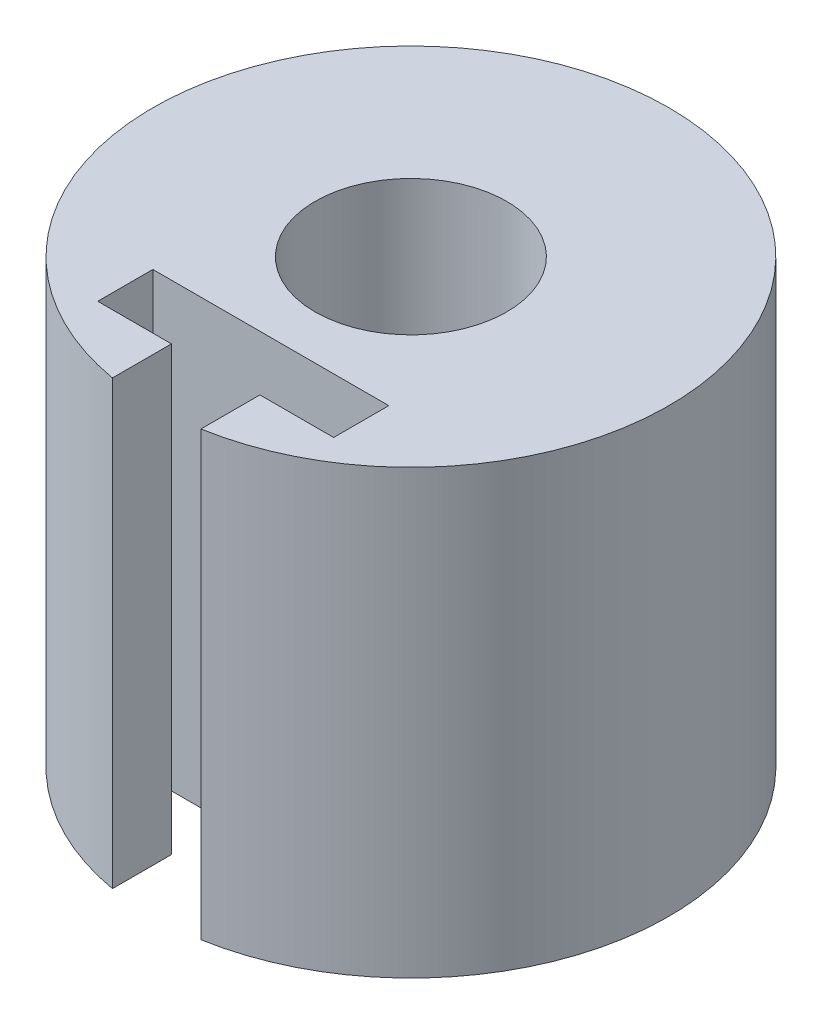
ISO-10303-21;
HEADER;
FILE_DESCRIPTION(('STEP AP214'),'2;1');
FILE_NAME('part.step','',(''),(''),'','','');
FILE_SCHEMA(('AUTOMOTIVE_DESIGN { 1 0 10303 214 1 1 1 1 }'));
ENDSEC;
DATA;
#1=APPLICATION_CONTEXT('core data for automotive mechanical design processes');
#2=APPLICATION_PROTOCOL_DEFINITION('international standard','automotive_design',2000,#1);
#3=PRODUCT_CONTEXT('',#1,'mechanical');
#4=PRODUCT('Part','Part','',(#3));
#5=PRODUCT_RELATED_PRODUCT_CATEGORY('part','',(#4));
#6=PRODUCT_DEFINITION_FORMATION('','',#4);
#7=PRODUCT_DEFINITION_CONTEXT('part definition',#1,'design');
#8=PRODUCT_DEFINITION('design','',#6,#7);
#9=PRODUCT_DEFINITION_SHAPE('','',#8);
#10=(LENGTH_UNIT() NAMED_UNIT(*) SI_UNIT(.MILLI.,.METRE.));
#11=(NAMED_UNIT(*) PLANE_ANGLE_UNIT() SI_UNIT($,.RADIAN.));
#12=(NAMED_UNIT(*) SI_UNIT($,.STERADIAN.) SOLID_ANGLE_UNIT());
#13=UNCERTAINTY_MEASURE_WITH_UNIT(LENGTH_MEASURE(1.E-05),#10,'distance_accuracy_value','');
#14=(GEOMETRIC_REPRESENTATION_CONTEXT(3) GLOBAL_UNCERTAINTY_ASSIGNED_CONTEXT((#13)) GLOBAL_UNIT_ASSIGNED_CONTEXT((#10,
#11,#12)) REPRESENTATION_CONTEXT('',''));
#15=CARTESIAN_POINT('',(0.,0.,0.));
#16=DIRECTION('',(0.,0.,1.));
#17=DIRECTION('',(1.,0.,0.));
#18=AXIS2_PLACEMENT_3D('',#15,#16,#17);
#19=CARTESIAN_POINT('',(0.,15.,0.));
#20=DIRECTION('',(0.,1.,0.));
#21=DIRECTION('',(0.,0.,1.));
#22=AXIS2_PLACEMENT_3D('',#19,#20,#21);
#23=PLANE('',#22);
#24=DIRECTION('',(-1.,0.,0.));
#25=VECTOR('',#24,1.);
#26=CARTESIAN_POINT('',(1.5,15.,4.75));
#27=LINE('',#26,#25);
#28=CARTESIAN_POINT('',(4.,15.,4.75));
#29=VERTEX_POINT('',#28);
#30=CARTESIAN_POINT('',(-4.,15.,4.75));
#31=VERTEX_POINT('',#30);
#32=EDGE_CURVE('E117',#29,#31,#27,.T.);
#33=ORIENTED_EDGE('',*,*,#32,.F.);
#34=DIRECTION('',(0.,0.,-1.));
#35=VECTOR('',#34,1.);
#36=CARTESIAN_POINT('',(4.,15.,6.62046982478334));
#37=LINE('',#36,#35);
#38=CARTESIAN_POINT('',(4.,15.,6.62046982478334));
#39=VERTEX_POINT('',#38);
#40=EDGE_CURVE('E126',#39,#29,#37,.T.);
#41=ORIENTED_EDGE('',*,*,#40,.F.);
#42=DIRECTION('',(-1.,0.,0.));
#43=VECTOR('',#42,1.);
#44=CARTESIAN_POINT('',(4.,15.,6.62046982478334));
#45=LINE('',#44,#43);
#46=CARTESIAN_POINT('',(1.5,15.,6.62046982478334));
#47=VERTEX_POINT('',#46);
#48=EDGE_CURVE('E153',#39,#47,#45,.T.);
#49=ORIENTED_EDGE('',*,*,#48,.T.);
#50=DIRECTION('',(0.,0.,1.));
#51=VECTOR('',#50,1.);
#52=CARTESIAN_POINT('',(1.5,15.,4.75));
#53=LINE('',#52,#51);
#54=CARTESIAN_POINT('',(1.5,15.,8.62046982478333));
#55=VERTEX_POINT('',#54);
#56=EDGE_CURVE('E240',#47,#55,#53,.T.);
#57=ORIENTED_EDGE('',*,*,#56,.T.);
#58=CARTESIAN_POINT('',(0.,15.,0.));
#59=DIRECTION('',(0.,1.,0.));
#60=DIRECTION('',(0.,0.,1.));
#61=AXIS2_PLACEMENT_3D('',#58,#59,#60);
#62=CIRCLE('',#61,8.75);
#63=CARTESIAN_POINT('',(-1.5,15.,8.62046982478333));
#64=VERTEX_POINT('',#63);
#65=EDGE_CURVE('E218',#55,#64,#62,.T.);
#66=ORIENTED_EDGE('',*,*,#65,.T.);
#67=DIRECTION('',(0.,0.,1.));
#68=VECTOR('',#67,1.);
#69=CARTESIAN_POINT('',(-1.5,15.,4.75));
#70=LINE('',#69,#68);
#71=CARTESIAN_POINT('',(-1.5,15.,6.62046982478334));
#72=VERTEX_POINT('',#71);
#73=EDGE_CURVE('E232',#72,#64,#70,.T.);
#74=ORIENTED_EDGE('',*,*,#73,.F.);
#75=CARTESIAN_POINT('',(-4.,15.,6.62046982478334));
#76=VERTEX_POINT('',#75);
#77=EDGE_CURVE('E56',#72,#76,#45,.T.);
#78=ORIENTED_EDGE('',*,*,#77,.T.);
#79=DIRECTION('',(0.,0.,-1.));
#80=VECTOR('',#79,1.);
#81=CARTESIAN_POINT('',(-4.,15.,6.62046982478334));
#82=LINE('',#81,#80);
#83=EDGE_CURVE('E128',#76,#31,#82,.T.);
#84=ORIENTED_EDGE('',*,*,#83,.T.);
#85=EDGE_LOOP('',(#33,#41,#49,#57,#66,#74,#78,#84));
#86=FACE_BOUND('',#85,.T.);
#87=CARTESIAN_POINT('',(0.,15.,0.));
#88=DIRECTION('',(0.,1.,0.));
#89=DIRECTION('',(0.,0.,1.));
#90=AXIS2_PLACEMENT_3D('',#87,#88,#89);
#91=CIRCLE('',#90,3.25);
#92=CARTESIAN_POINT('',(0.,15.,3.25));
#93=VERTEX_POINT('',#92);
#94=EDGE_CURVE('E219',#93,#93,#91,.T.);
#95=ORIENTED_EDGE('',*,*,#94,.F.);
#96=EDGE_LOOP('',(#95));
#97=FACE_BOUND('',#96,.T.);
#98=ADVANCED_FACE('F39',(#86,#97),#23,.T.);
#99=CARTESIAN_POINT('',(0.,0.,0.));
#100=DIRECTION('',(0.,1.,0.));
#101=DIRECTION('',(0.,0.,1.));
#102=AXIS2_PLACEMENT_3D('',#99,#100,#101);
#103=PLANE('',#102);
#104=DIRECTION('',(0.,0.,1.));
#105=VECTOR('',#104,1.);
#106=CARTESIAN_POINT('',(4.,0.,6.62046982478334));
#107=LINE('',#106,#105);
#108=CARTESIAN_POINT('',(4.,0.,4.75));
#109=VERTEX_POINT('',#108);
#110=CARTESIAN_POINT('',(4.,0.,6.62046982478334));
#111=VERTEX_POINT('',#110);
#112=EDGE_CURVE('E124',#109,#111,#107,.T.);
#113=ORIENTED_EDGE('',*,*,#112,.F.);
#114=DIRECTION('',(1.,0.,0.));
#115=VECTOR('',#114,1.);
#116=CARTESIAN_POINT('',(1.5,0.,4.75));
#117=LINE('',#116,#115);
#118=CARTESIAN_POINT('',(-4.,0.,4.75));
#119=VERTEX_POINT('',#118);
#120=EDGE_CURVE('E105',#119,#109,#117,.T.);
#121=ORIENTED_EDGE('',*,*,#120,.F.);
#122=DIRECTION('',(0.,0.,1.));
#123=VECTOR('',#122,1.);
#124=CARTESIAN_POINT('',(-4.,0.,6.62046982478334));
#125=LINE('',#124,#123);
#126=CARTESIAN_POINT('',(-4.,0.,6.62046982478334));
#127=VERTEX_POINT('',#126);
#128=EDGE_CURVE('E144',#119,#127,#125,.T.);
#129=ORIENTED_EDGE('',*,*,#128,.T.);
#130=DIRECTION('',(-1.,0.,0.));
#131=VECTOR('',#130,1.);
#132=CARTESIAN_POINT('',(4.,0.,6.62046982478334));
#133=LINE('',#132,#131);
#134=CARTESIAN_POINT('',(-1.5,0.,6.62046982478334));
#135=VERTEX_POINT('',#134);
#136=EDGE_CURVE('E141',#135,#127,#133,.T.);
#137=ORIENTED_EDGE('',*,*,#136,.F.);
#138=DIRECTION('',(0.,0.,1.));
#139=VECTOR('',#138,1.);
#140=CARTESIAN_POINT('',(-1.5,0.,4.75));
#141=LINE('',#140,#139);
#142=CARTESIAN_POINT('',(-1.5,0.,8.62046982478333));
#143=VERTEX_POINT('',#142);
#144=EDGE_CURVE('E234',#135,#143,#141,.T.);
#145=ORIENTED_EDGE('',*,*,#144,.T.);
#146=CARTESIAN_POINT('',(0.,0.,0.));
#147=DIRECTION('',(0.,1.,0.));
#148=DIRECTION('',(0.,0.,1.));
#149=AXIS2_PLACEMENT_3D('',#146,#147,#148);
#150=CIRCLE('',#149,8.75);
#151=CARTESIAN_POINT('',(1.5,0.,8.62046982478333));
#152=VERTEX_POINT('',#151);
#153=EDGE_CURVE('E211',#152,#143,#150,.T.);
#154=ORIENTED_EDGE('',*,*,#153,.F.);
#155=DIRECTION('',(0.,0.,1.));
#156=VECTOR('',#155,1.);
#157=CARTESIAN_POINT('',(1.5,0.,4.75));
#158=LINE('',#157,#156);
#159=CARTESIAN_POINT('',(1.5,0.,6.62046982478334));
#160=VERTEX_POINT('',#159);
#161=EDGE_CURVE('E237',#160,#152,#158,.T.);
#162=ORIENTED_EDGE('',*,*,#161,.F.);
#163=EDGE_CURVE('E64',#111,#160,#133,.T.);
#164=ORIENTED_EDGE('',*,*,#163,.F.);
#165=EDGE_LOOP('',(#113,#121,#129,#137,#145,#154,#162,#164));
#166=FACE_BOUND('',#165,.T.);
#167=CARTESIAN_POINT('',(0.,0.,0.));
#168=DIRECTION('',(0.,1.,0.));
#169=DIRECTION('',(0.,0.,1.));
#170=AXIS2_PLACEMENT_3D('',#167,#168,#169);
#171=CIRCLE('',#170,3.25);
#172=CARTESIAN_POINT('',(0.,0.,3.25));
#173=VERTEX_POINT('',#172);
#174=EDGE_CURVE('E225',#173,#173,#171,.T.);
#175=ORIENTED_EDGE('',*,*,#174,.T.);
#176=EDGE_LOOP('',(#175));
#177=FACE_BOUND('',#176,.T.);
#178=ADVANCED_FACE('F130',(#166,#177),#103,.F.);
#179=CARTESIAN_POINT('',(0.,15.,0.));
#180=DIRECTION('',(0.,-1.,0.));
#181=DIRECTION('',(0.,0.,-1.));
#182=AXIS2_PLACEMENT_3D('',#179,#180,#181);
#183=CYLINDRICAL_SURFACE('',#182,8.75);
#184=CARTESIAN_POINT('',(-1.25,7.5,-8.66025403784439));
#185=CARTESIAN_POINT('',(-1.2499970882253,7.43017239298044,-8.66025516085875));
#186=CARTESIAN_POINT('',(-1.24412915317117,7.36030330453426,-8.66110770052372));
#187=CARTESIAN_POINT('',(-1.2208171258649,7.22251585225125,-8.66442374528039));
#188=CARTESIAN_POINT('',(-1.20336149763599,7.15459950280618,-8.66688885571018));
#189=CARTESIAN_POINT('',(-1.15740461772674,7.0227320624764,-8.67314526632927));
#190=CARTESIAN_POINT('',(-1.12891154451268,6.95877807618568,-8.67693558437125));
#191=CARTESIAN_POINT('',(-1.06170734930789,6.83656891908396,-8.68541416628935));
#192=CARTESIAN_POINT('',(-1.02299773687961,6.77831290810022,-8.69010229747946));
#193=CARTESIAN_POINT('',(-0.936158417751142,6.66871981509502,-8.69988640783336));
#194=CARTESIAN_POINT('',(-0.887969102670785,6.61743017883371,-8.70498484045085));
#195=CARTESIAN_POINT('',(-0.783666924354489,6.52363652672474,-8.71499314449397));
#196=CARTESIAN_POINT('',(-0.72755363865696,6.48113297959986,-8.71990300584828));
#197=CARTESIAN_POINT('',(-0.608693990012801,6.40594431390017,-8.72900648139207));
#198=CARTESIAN_POINT('',(-0.545919853885056,6.37330267842597,-8.73319688933394));
#199=CARTESIAN_POINT('',(-0.415710466226937,6.31904329042012,-8.74036219658094));
#200=CARTESIAN_POINT('',(-0.348275438774581,6.29742500834538,-8.74333715427286));
#201=CARTESIAN_POINT('',(-0.211146289713093,6.26596924564733,-8.74771906255606));
#202=CARTESIAN_POINT('',(-0.141470703168673,6.2560524562711,-8.74913656448817));
#203=CARTESIAN_POINT('',(-0.00143097829899894,6.24803506339587,-8.75027997177396));
#204=CARTESIAN_POINT('',(0.0689331249628623,6.24993386127118,-8.75000596282645));
#205=CARTESIAN_POINT('',(0.207811870116169,6.26543086138488,-8.74780568414539));
#206=CARTESIAN_POINT('',(0.276336249856897,6.27894374930157,-8.74589146332768));
#207=CARTESIAN_POINT('',(0.410134746955434,6.317151599812,-8.74063928382897));
#208=CARTESIAN_POINT('',(0.475408787038677,6.34184682811737,-8.73730129131682));
#209=CARTESIAN_POINT('',(0.601113729229836,6.40180671548973,-8.72955587731864));
#210=CARTESIAN_POINT('',(0.661527120494418,6.43710759444927,-8.7251448010732));
#211=CARTESIAN_POINT('',(0.775604887586029,6.51725030796266,-8.71574541685143));
#212=CARTESIAN_POINT('',(0.829268859632394,6.56209271290201,-8.71075707437468));
#213=CARTESIAN_POINT('',(0.928826869414913,6.66052162604749,-8.70070753089877));
#214=CARTESIAN_POINT('',(0.974647308326149,6.71418258296824,-8.69564607694519));
#215=CARTESIAN_POINT('',(1.05664368493827,6.82847157589343,-8.6860643367229));
#216=CARTESIAN_POINT('',(1.09281957322612,6.88909964759101,-8.68154405322691));
#217=CARTESIAN_POINT('',(1.15450813450497,7.01567518119136,-8.67355658551828));
#218=CARTESIAN_POINT('',(1.18001375157361,7.08162612867663,-8.67009009856167));
#219=CARTESIAN_POINT('',(1.219566398177,7.21693598739118,-8.66461541130593));
#220=CARTESIAN_POINT('',(1.23361415675189,7.28629468149473,-8.6626071182258));
#221=CARTESIAN_POINT('',(1.24975244180121,7.42579783589377,-8.66029362973324));
#222=CARTESIAN_POINT('',(1.25194706940295,7.49593001624724,-8.65997360751942));
#223=CARTESIAN_POINT('',(1.2445925515445,7.63556112814072,-8.66103357832946));
#224=CARTESIAN_POINT('',(1.23504373552106,7.70506007738956,-8.66241352366445));
#225=CARTESIAN_POINT('',(1.20456148659501,7.84113261251778,-8.66670435328227));
#226=CARTESIAN_POINT('',(1.18367947402763,7.90771795441584,-8.66960832090782));
#227=CARTESIAN_POINT('',(1.13117691357165,8.03644299841031,-8.67661432007607));
#228=CARTESIAN_POINT('',(1.09955588106338,8.09858249972608,-8.68071640568507));
#229=CARTESIAN_POINT('',(1.02622100207016,8.21711992482593,-8.68969155258386));
#230=CARTESIAN_POINT('',(0.98443950016953,8.27347560075772,-8.6945697028269));
#231=CARTESIAN_POINT('',(0.892064236383529,8.37841232726594,-8.70453181791204));
#232=CARTESIAN_POINT('',(0.841470023876353,8.42699298003695,-8.70961579326842));
#233=CARTESIAN_POINT('',(0.732448178928346,8.51537201152112,-8.71946282758694));
#234=CARTESIAN_POINT('',(0.673964482577705,8.5551015764497,-8.72422318476158));
#235=CARTESIAN_POINT('',(0.551092940481996,8.62417222695982,-8.73284513474877));
#236=CARTESIAN_POINT('',(0.486705243860285,8.65351357483622,-8.73670675025305));
#237=CARTESIAN_POINT('',(0.354072452871208,8.70086382144732,-8.74308423652776));
#238=CARTESIAN_POINT('',(0.285841249452456,8.71891099289218,-8.74560464785764));
#239=CARTESIAN_POINT('',(0.147278286903616,8.74328466694163,-8.74903474447829));
#240=CARTESIAN_POINT('',(0.0769466533214239,8.74961186865866,-8.74994452584523));
#241=CARTESIAN_POINT('',(-0.0631519566419731,8.75035014934029,-8.75005004794948));
#242=CARTESIAN_POINT('',(-0.132918388594115,8.74486676188652,-8.74926096888997));
#243=CARTESIAN_POINT('',(-0.27052664592492,8.7223649062231,-8.74608790171903));
#244=CARTESIAN_POINT('',(-0.338368475847152,8.70534646524758,-8.74370391737315));
#245=CARTESIAN_POINT('',(-0.470177321560782,8.66029376410738,-8.73760763783911));
#246=CARTESIAN_POINT('',(-0.534146643879365,8.63226613719704,-8.73389614262293));
#247=CARTESIAN_POINT('',(-0.656491066157176,8.56600178174873,-8.72555350063933));
#248=CARTESIAN_POINT('',(-0.714866018729095,8.52776478433868,-8.72092232965232));
#249=CARTESIAN_POINT('',(-0.824901218501657,8.44178267798539,-8.71120654664669));
#250=CARTESIAN_POINT('',(-0.87650010394991,8.39395943322969,-8.7061184116192));
#251=CARTESIAN_POINT('',(-0.970979479545268,8.29032652485293,-8.69608889641356));
#252=CARTESIAN_POINT('',(-1.01385791644206,8.23451498562715,-8.69114755103072));
#253=CARTESIAN_POINT('',(-1.08987202172246,8.11615910104024,-8.68194429907431));
#254=CARTESIAN_POINT('',(-1.12295721438123,8.05358206849311,-8.67768596267398));
#255=CARTESIAN_POINT('',(-1.17809939066933,7.92372981462212,-8.67037267584611));
#256=CARTESIAN_POINT('',(-1.20016798701335,7.85645962605154,-8.6673164589752));
#257=CARTESIAN_POINT('',(-1.22755784478488,7.74072723385606,-8.66347057636991));
#258=CARTESIAN_POINT('',(-1.23596101580969,7.69298479036888,-8.66227064996284));
#259=CARTESIAN_POINT('',(-1.24718307192828,7.59683487689588,-8.66066199569781));
#260=CARTESIAN_POINT('',(-1.25000201939786,7.54842741434441,-8.66025325900226));
#261=CARTESIAN_POINT('',(-1.25,7.5,-8.66025403784439));
#262=B_SPLINE_CURVE_WITH_KNOTS('',3,(#184,#185,#186,#187,#188,#189,#190,#191,#192,#193,#194,
#195,#196,#197,#198,#199,#200,#201,#202,#203,#204,#205,#206,#207,#208,#209,#210,#211,#212,#213,
#214,#215,#216,#217,#218,#219,#220,#221,#222,#223,#224,#225,#226,#227,#228,#229,#230,#231,#232,
#233,#234,#235,#236,#237,#238,#239,#240,#241,#242,#243,#244,#245,#246,#247,#248,#249,#250,#251,
#252,#253,#254,#255,#256,#257,#258,#259,#260,#261),.UNSPECIFIED.,.T.,.F.,(4,2,2,2,2,2,2,2,2,2,2,
2,2,2,2,2,2,2,2,2,2,2,2,2,2,2,2,2,2,2,2,2,2,2,2,2,2,2,4),(0.,0.209305843372431,0.41882037156305,
0.628179950855115,0.837508613161047,1.0481982227905,1.25889906944998,1.47051581670914,
1.682122397303,1.89228638835049,2.10243973172225,2.31106240565563,2.51969003708232,
2.72903842274279,2.93839932661562,3.14962823739814,3.36085823037336,3.57222768330331,
3.7835836861771,3.99308038175012,4.20257120048353,4.41111938001099,4.61967697194116,
4.82966325630577,5.03966028108788,5.25123700949766,5.46280839536948,5.6736588883523,
5.88449680340601,6.09345859563453,6.3024198945085,6.51125548267865,6.72009657124655,
6.93071468316326,7.14138232834847,7.35311759694997,7.56462919928973,7.70979032476675,
7.85494982878448),.UNSPECIFIED.);
#263=CARTESIAN_POINT('',(-1.25,7.5,-8.66025403784439));
#264=VERTEX_POINT('',#263);
#265=EDGE_CURVE('E118',#264,#264,#262,.T.);
#266=ORIENTED_EDGE('',*,*,#265,.T.);
#267=EDGE_LOOP('',(#266));
#268=FACE_BOUND('',#267,.T.);
#269=ORIENTED_EDGE('',*,*,#153,.T.);
#270=DIRECTION('',(0.,-1.,0.));
#271=VECTOR('',#270,1.);
#272=CARTESIAN_POINT('',(-1.5,15.,8.62046982478333));
#273=LINE('',#272,#271);
#274=EDGE_CURVE('E49',#143,#64,#273,.F.);
#275=ORIENTED_EDGE('',*,*,#274,.T.);
#276=ORIENTED_EDGE('',*,*,#65,.F.);
#277=DIRECTION('',(0.,-1.,0.));
#278=VECTOR('',#277,1.);
#279=CARTESIAN_POINT('',(1.5,15.,8.62046982478333));
#280=LINE('',#279,#278);
#281=EDGE_CURVE('E216',#55,#152,#280,.T.);
#282=ORIENTED_EDGE('',*,*,#281,.T.);
#283=EDGE_LOOP('',(#269,#275,#276,#282));
#284=FACE_BOUND('',#283,.T.);
#285=ADVANCED_FACE('F41',(#268,#284),#183,.T.);
#286=CARTESIAN_POINT('',(0.,15.,0.));
#287=DIRECTION('',(0.,-1.,0.));
#288=DIRECTION('',(0.,0.,-1.));
#289=AXIS2_PLACEMENT_3D('',#286,#287,#288);
#290=CYLINDRICAL_SURFACE('',#289,3.25);
#291=CARTESIAN_POINT('',(0.,8.75,-3.25));
#292=CARTESIAN_POINT('',(-0.0675715319872352,8.75000303631721,-3.2500023149315));
#293=CARTESIAN_POINT('',(-0.135122841845089,8.7445039948339,-3.24787460914854));
#294=CARTESIAN_POINT('',(-0.268199946838178,8.72274766015385,-3.23960030250703));
#295=CARTESIAN_POINT('',(-0.333726144664666,8.7064925203908,-3.23345450609663));
#296=CARTESIAN_POINT('',(-0.4608140016126,8.66388845342125,-3.21780164663319));
#297=CARTESIAN_POINT('',(-0.522383267326385,8.63755961318974,-3.20830127549684));
#298=CARTESIAN_POINT('',(-0.640224544506604,8.57566045663878,-3.18687996346555));
#299=CARTESIAN_POINT('',(-0.696495054794847,8.54008753206648,-3.17495833961286));
#300=CARTESIAN_POINT('',(-0.804636293372719,8.45906521424815,-3.14932893991409));
#301=CARTESIAN_POINT('',(-0.856241364855515,8.41327796916809,-3.13556882696303));
#302=CARTESIAN_POINT('',(-0.951256867062644,8.31384395559603,-3.10806394131879));
#303=CARTESIAN_POINT('',(-0.994664596666784,8.26019460675492,-3.09431917516047));
#304=CARTESIAN_POINT('',(-1.0737867083932,8.14391251040571,-3.06778373334949));
#305=CARTESIAN_POINT('',(-1.10911831550721,8.08100393570335,-3.05505424227563));
#306=CARTESIAN_POINT('',(-1.16858094588668,7.94957167008903,-3.03280959270519));
#307=CARTESIAN_POINT('',(-1.19271670784166,7.88105036926284,-3.02329307476899));
#308=CARTESIAN_POINT('',(-1.22804131451018,7.74340163188701,-3.00911365406257));
#309=CARTESIAN_POINT('',(-1.23973900600496,7.6744250233461,-3.00426084590652));
#310=CARTESIAN_POINT('',(-1.25144599737597,7.53533027001152,-2.99940447415263));
#311=CARTESIAN_POINT('',(-1.25146045221258,7.46521264232329,-2.99939877188037));
#312=CARTESIAN_POINT('',(-1.24018828156472,7.33056787092411,-3.00407418786815));
#313=CARTESIAN_POINT('',(-1.22961897853223,7.26596839354261,-3.00845781466544));
#314=CARTESIAN_POINT('',(-1.19866903066717,7.1395424602967,-3.02092170191416));
#315=CARTESIAN_POINT('',(-1.17828682871463,7.07771644623071,-3.02900254903386));
#316=CARTESIAN_POINT('',(-1.12791331961451,6.95717084410887,-3.04812185084554));
#317=CARTESIAN_POINT('',(-1.09774225238327,6.89853542389155,-3.0592149459748));
#318=CARTESIAN_POINT('',(-1.02877305801412,6.7869560607492,-3.08309183835604));
#319=CARTESIAN_POINT('',(-0.989971846179747,6.73401416293854,-3.09587623947249));
#320=CARTESIAN_POINT('',(-0.901602576664665,6.63137041937713,-3.12280172590231));
#321=CARTESIAN_POINT('',(-0.851465722247016,6.58216539019501,-3.13697469419896));
#322=CARTESIAN_POINT('',(-0.743493195227884,6.49270966535827,-3.16430343412909));
#323=CARTESIAN_POINT('',(-0.685656216014993,6.45246049249968,-3.17745903252783));
#324=CARTESIAN_POINT('',(-0.562604553775406,6.38147247589254,-3.20155703366155));
#325=CARTESIAN_POINT('',(-0.497281049578299,6.35090717120342,-3.21245795349723));
#326=CARTESIAN_POINT('',(-0.361894833206753,6.30136694872555,-3.23050850718));
#327=CARTESIAN_POINT('',(-0.291834356982482,6.28238660443469,-3.23765989711974));
#328=CARTESIAN_POINT('',(-0.153137937021178,6.25752890911886,-3.24709261562521));
#329=CARTESIAN_POINT('',(-0.0846385886268604,6.25098306052081,-3.24962211024217));
#330=CARTESIAN_POINT('',(0.0525190280348351,6.24922328098163,-3.25029853047616));
#331=CARTESIAN_POINT('',(0.121177255058641,6.25400668061401,-3.24844648848219));
#332=CARTESIAN_POINT('',(0.253761695742295,6.27426754217008,-3.2407312632648));
#333=CARTESIAN_POINT('',(0.317766639316312,6.28930015301566,-3.23503503188821));
#334=CARTESIAN_POINT('',(0.442295556209771,6.32903961525066,-3.22037397608214));
#335=CARTESIAN_POINT('',(0.502819076916698,6.35374772128544,-3.21140872776155));
#336=CARTESIAN_POINT('',(0.620698813636759,6.41293380761667,-3.19075581436406));
#337=CARTESIAN_POINT('',(0.677906145488645,6.44768190718881,-3.17899474049622));
#338=CARTESIAN_POINT('',(0.785873604730286,6.52565856406374,-3.1540415650036));
#339=CARTESIAN_POINT('',(0.836631256219869,6.56889036197836,-3.14084891740835));
#340=CARTESIAN_POINT('',(0.933504331729476,6.66570987534166,-3.11347991164931));
#341=CARTESIAN_POINT('',(0.979146999519691,6.71976876948459,-3.09929267810059));
#342=CARTESIAN_POINT('',(1.06081490378282,6.83504770132101,-3.07229993927653));
#343=CARTESIAN_POINT('',(1.09683902385514,6.89626856910179,-3.05949459449622));
#344=CARTESIAN_POINT('',(1.15835082942972,7.02478802369851,-3.03674349435567));
#345=CARTESIAN_POINT('',(1.18377287536295,7.09212141961737,-3.02681566635818));
#346=CARTESIAN_POINT('',(1.22273931393276,7.23060530275171,-3.01128826378359));
#347=CARTESIAN_POINT('',(1.23629158182411,7.30175322583002,-3.00568581973212));
#348=CARTESIAN_POINT('',(1.25041105266473,7.44069430043409,-2.99983751343063));
#349=CARTESIAN_POINT('',(1.25178981471631,7.50839150953481,-2.99925692156742));
#350=CARTESIAN_POINT('',(1.24362206426042,7.64300054621735,-3.00265273739252));
#351=CARTESIAN_POINT('',(1.23407670421825,7.70991245589384,-3.00662866438049));
#352=CARTESIAN_POINT('',(1.20497568370843,7.83874803140137,-3.01840446138006));
#353=CARTESIAN_POINT('',(1.18576914198388,7.90076385115595,-3.02607059148608));
#354=CARTESIAN_POINT('',(1.13820557579799,8.02072489672963,-3.04427878157858));
#355=CARTESIAN_POINT('',(1.10984618369931,8.07866906457581,-3.05482158558695));
#356=CARTESIAN_POINT('',(1.04299659752551,8.19226765178712,-3.07830739157189));
#357=CARTESIAN_POINT('',(1.00403969714007,8.24762662073787,-3.09134967831024));
#358=CARTESIAN_POINT('',(0.917807869951625,8.35127985895452,-3.11803853050207));
#359=CARTESIAN_POINT('',(0.870530230994191,8.39957181529068,-3.1316852918961));
#360=CARTESIAN_POINT('',(0.76571915109508,8.49058768798449,-3.15899802583486));
#361=CARTESIAN_POINT('',(0.707749414676573,8.53282502946979,-3.17261904042444));
#362=CARTESIAN_POINT('',(0.585053581185314,8.6069554298214,-3.19751913808163));
#363=CARTESIAN_POINT('',(0.520326352364091,8.63884675224536,-3.20879782790683));
#364=CARTESIAN_POINT('',(0.381450421116216,8.69285220950936,-3.2283456971883));
#365=CARTESIAN_POINT('',(0.306962518765693,8.71419218802749,-3.23637035277149));
#366=CARTESIAN_POINT('',(0.154973048922118,8.74276030246231,-3.24719468122098));
#367=CARTESIAN_POINT('',(0.077473233000172,8.74999651875126,-3.24999734584636));
#368=CARTESIAN_POINT('',(0.,8.75,-3.25));
#369=B_SPLINE_CURVE_WITH_KNOTS('',3,(#291,#292,#293,#294,#295,#296,#297,#298,#299,#300,#301,
#302,#303,#304,#305,#306,#307,#308,#309,#310,#311,#312,#313,#314,#315,#316,#317,#318,#319,#320,
#321,#322,#323,#324,#325,#326,#327,#328,#329,#330,#331,#332,#333,#334,#335,#336,#337,#338,#339,
#340,#341,#342,#343,#344,#345,#346,#347,#348,#349,#350,#351,#352,#353,#354,#355,#356,#357,#358,
#359,#360,#361,#362,#363,#364,#365,#366,#367,#368),.UNSPECIFIED.,.T.,.F.,(4,2,2,2,2,2,2,2,2,2,2,
2,2,2,2,2,2,2,2,2,2,2,2,2,2,2,2,2,2,2,2,2,2,2,2,2,2,2,4),(0.,0.202428697836589,
0.404816880522634,0.606803586491719,0.808847345759679,1.01896451651433,1.22915080298934,
1.44784953856366,1.66645562430895,1.87572683039198,2.08490570030165,2.28080611544245,
2.47673762649501,2.67649275557438,2.87631939875082,3.09033174160947,3.30438044598557,
3.52207253200372,3.73966257063379,3.94518139489807,4.15065179910813,4.34772843207335,
4.54483062891919,4.74782830480281,4.95090367341617,5.16637996427094,5.3818812540546,
5.59869762908324,5.81537004350373,6.01747891552894,6.21956646758057,6.41482600959235,
6.61013610141035,6.8160576577016,7.02204645909395,7.24000425894954,7.45799862123391,
7.69022361381185,7.92231552015457),.UNSPECIFIED.);
#370=CARTESIAN_POINT('',(0.,8.75,-3.25));
#371=VERTEX_POINT('',#370);
#372=EDGE_CURVE('E162',#371,#371,#369,.T.);
#373=ORIENTED_EDGE('',*,*,#372,.F.);
#374=EDGE_LOOP('',(#373));
#375=FACE_BOUND('',#374,.T.);
#376=ORIENTED_EDGE('',*,*,#94,.T.);
#377=EDGE_LOOP('',(#376));
#378=FACE_BOUND('',#377,.T.);
#379=ORIENTED_EDGE('',*,*,#174,.F.);
#380=EDGE_LOOP('',(#379));
#381=FACE_BOUND('',#380,.T.);
#382=ADVANCED_FACE('F189',(#375,#378,#381),#290,.F.);
#383=CARTESIAN_POINT('',(-1.5,0.,4.75));
#384=DIRECTION('',(-1.,0.,0.));
#385=DIRECTION('',(0.,0.,1.));
#386=AXIS2_PLACEMENT_3D('',#383,#384,#385);
#387=PLANE('',#386);
#388=ORIENTED_EDGE('',*,*,#144,.F.);
#389=DIRECTION('',(0.,1.,0.));
#390=VECTOR('',#389,1.);
#391=CARTESIAN_POINT('',(-1.5,0.,6.62046982478334));
#392=LINE('',#391,#390);
#393=EDGE_CURVE('E157',#135,#72,#392,.T.);
#394=ORIENTED_EDGE('',*,*,#393,.T.);
#395=ORIENTED_EDGE('',*,*,#73,.T.);
#396=ORIENTED_EDGE('',*,*,#274,.F.);
#397=EDGE_LOOP('',(#388,#394,#395,#396));
#398=FACE_BOUND('',#397,.T.);
#399=ADVANCED_FACE('F194',(#398),#387,.F.);
#400=CARTESIAN_POINT('',(1.5,0.,4.75));
#401=DIRECTION('',(1.,0.,0.));
#402=DIRECTION('',(0.,0.,-1.));
#403=AXIS2_PLACEMENT_3D('',#400,#401,#402);
#404=PLANE('',#403);
#405=ORIENTED_EDGE('',*,*,#56,.F.);
#406=DIRECTION('',(0.,-1.,0.));
#407=VECTOR('',#406,1.);
#408=CARTESIAN_POINT('',(1.5,0.,6.62046982478334));
#409=LINE('',#408,#407);
#410=EDGE_CURVE('E11',#47,#160,#409,.T.);
#411=ORIENTED_EDGE('',*,*,#410,.T.);
#412=ORIENTED_EDGE('',*,*,#161,.T.);
#413=ORIENTED_EDGE('',*,*,#281,.F.);
#414=EDGE_LOOP('',(#405,#411,#412,#413));
#415=FACE_BOUND('',#414,.T.);
#416=ADVANCED_FACE('F257',(#415),#404,.F.);
#417=CARTESIAN_POINT('',(0.,0.,4.75));
#418=DIRECTION('',(0.,0.,1.));
#419=DIRECTION('',(1.,0.,0.));
#420=AXIS2_PLACEMENT_3D('',#417,#418,#419);
#421=PLANE('',#420);
#422=ORIENTED_EDGE('',*,*,#32,.T.);
#423=DIRECTION('',(0.,-1.,0.));
#424=VECTOR('',#423,1.);
#425=CARTESIAN_POINT('',(-4.,0.,4.75));
#426=LINE('',#425,#424);
#427=EDGE_CURVE('E111',#31,#119,#426,.T.);
#428=ORIENTED_EDGE('',*,*,#427,.T.);
#429=ORIENTED_EDGE('',*,*,#120,.T.);
#430=DIRECTION('',(0.,-1.,0.));
#431=VECTOR('',#430,1.);
#432=CARTESIAN_POINT('',(4.,0.,4.75));
#433=LINE('',#432,#431);
#434=EDGE_CURVE('E108',#29,#109,#433,.T.);
#435=ORIENTED_EDGE('',*,*,#434,.F.);
#436=EDGE_LOOP('',(#422,#428,#429,#435));
#437=FACE_BOUND('',#436,.T.);
#438=ADVANCED_FACE('F107',(#437),#421,.T.);
#439=CARTESIAN_POINT('',(0.,7.5,-0.750000000000002));
#440=DIRECTION('',(0.,0.,-1.));
#441=DIRECTION('',(-1.,0.,0.));
#442=AXIS2_PLACEMENT_3D('',#439,#440,#441);
#443=CYLINDRICAL_SURFACE('',#442,1.25);
#444=ORIENTED_EDGE('',*,*,#372,.T.);
#445=EDGE_LOOP('',(#444));
#446=FACE_BOUND('',#445,.T.);
#447=ORIENTED_EDGE('',*,*,#265,.F.);
#448=EDGE_LOOP('',(#447));
#449=FACE_BOUND('',#448,.T.);
#450=ADVANCED_FACE('F170',(#446,#449),#443,.F.);
#451=CARTESIAN_POINT('',(4.,0.,6.62046982478334));
#452=DIRECTION('',(0.,0.,1.));
#453=DIRECTION('',(1.,0.,0.));
#454=AXIS2_PLACEMENT_3D('',#451,#452,#453);
#455=PLANE('',#454);
#456=ORIENTED_EDGE('',*,*,#48,.F.);
#457=DIRECTION('',(0.,1.,0.));
#458=VECTOR('',#457,1.);
#459=CARTESIAN_POINT('',(4.,0.,6.62046982478334));
#460=LINE('',#459,#458);
#461=EDGE_CURVE('E134',#111,#39,#460,.T.);
#462=ORIENTED_EDGE('',*,*,#461,.F.);
#463=ORIENTED_EDGE('',*,*,#163,.T.);
#464=ORIENTED_EDGE('',*,*,#410,.F.);
#465=EDGE_LOOP('',(#456,#462,#463,#464));
#466=FACE_BOUND('',#465,.T.);
#467=ADVANCED_FACE('F175',(#466),#455,.F.);
#468=CARTESIAN_POINT('',(4.,0.,0.));
#469=DIRECTION('',(-1.,0.,0.));
#470=DIRECTION('',(0.,0.,1.));
#471=AXIS2_PLACEMENT_3D('',#468,#469,#470);
#472=PLANE('',#471);
#473=ORIENTED_EDGE('',*,*,#434,.T.);
#474=ORIENTED_EDGE('',*,*,#112,.T.);
#475=ORIENTED_EDGE('',*,*,#461,.T.);
#476=ORIENTED_EDGE('',*,*,#40,.T.);
#477=EDGE_LOOP('',(#473,#474,#475,#476));
#478=FACE_BOUND('',#477,.T.);
#479=ADVANCED_FACE('F122',(#478),#472,.T.);
#480=ORIENTED_EDGE('',*,*,#136,.T.);
#481=DIRECTION('',(0.,1.,0.));
#482=VECTOR('',#481,1.);
#483=CARTESIAN_POINT('',(-4.,0.,6.62046982478334));
#484=LINE('',#483,#482);
#485=EDGE_CURVE('E147',#127,#76,#484,.T.);
#486=ORIENTED_EDGE('',*,*,#485,.T.);
#487=ORIENTED_EDGE('',*,*,#77,.F.);
#488=ORIENTED_EDGE('',*,*,#393,.F.);
#489=EDGE_LOOP('',(#480,#486,#487,#488));
#490=FACE_BOUND('',#489,.T.);
#491=ADVANCED_FACE('F177',(#490),#455,.F.);
#492=CARTESIAN_POINT('',(-4.,0.,0.));
#493=DIRECTION('',(-1.,0.,0.));
#494=DIRECTION('',(0.,0.,1.));
#495=AXIS2_PLACEMENT_3D('',#492,#493,#494);
#496=PLANE('',#495);
#497=ORIENTED_EDGE('',*,*,#427,.F.);
#498=ORIENTED_EDGE('',*,*,#83,.F.);
#499=ORIENTED_EDGE('',*,*,#485,.F.);
#500=ORIENTED_EDGE('',*,*,#128,.F.);
#501=EDGE_LOOP('',(#497,#498,#499,#500));
#502=FACE_BOUND('',#501,.T.);
#503=ADVANCED_FACE('F247',(#502),#496,.F.);
#504=CLOSED_SHELL('',(#98,#178,#285,#382,#399,#416,#438,#450,#467,#479,#491,#503));
#505=MANIFOLD_SOLID_BREP('B2',#504);
#506=ADVANCED_BREP_SHAPE_REPRESENTATION('',(#18,#505),#14);
#507=SHAPE_DEFINITION_REPRESENTATION(#9,#506);
ENDSEC;
END-ISO-10303-21;
